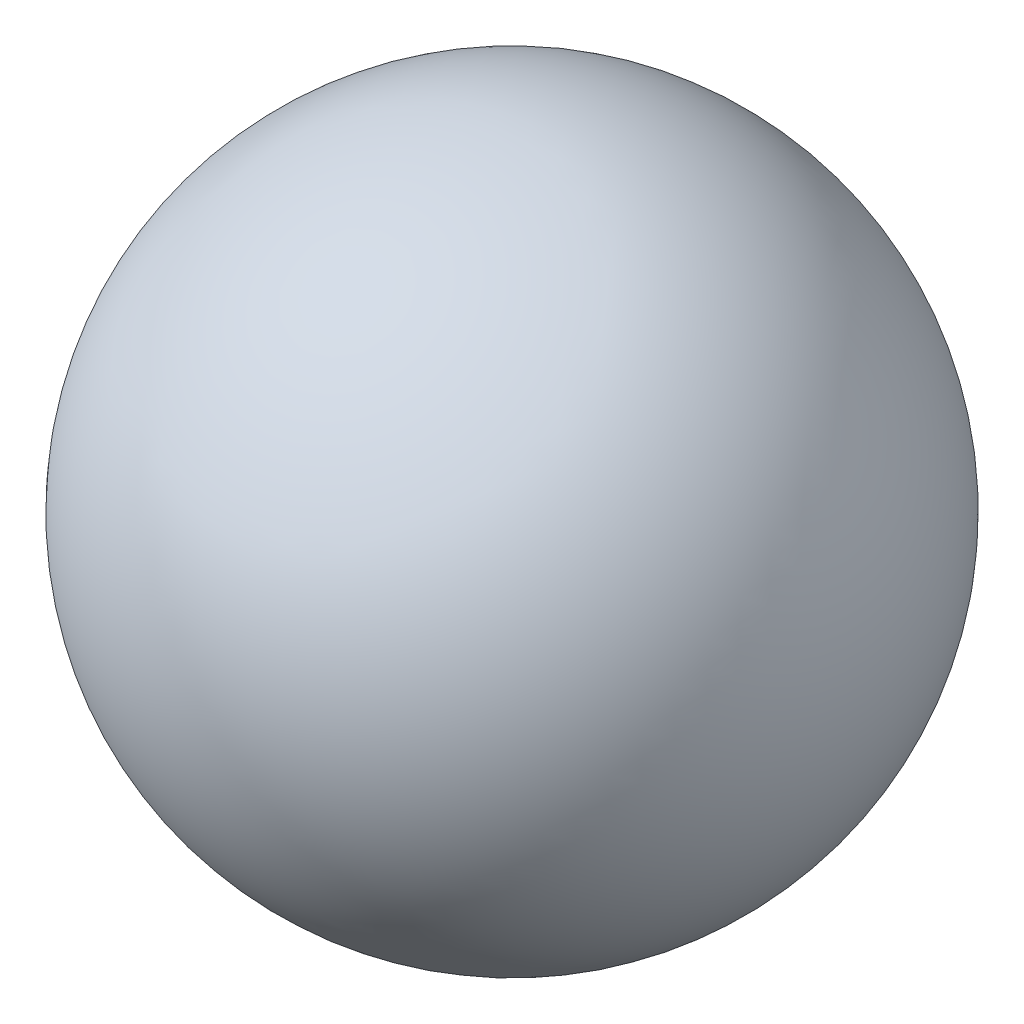
ISO-10303-21;
HEADER;
FILE_DESCRIPTION(('STEP AP214'),'2;1');
FILE_NAME('part.step','',(''),(''),'','','');
FILE_SCHEMA(('AUTOMOTIVE_DESIGN { 1 0 10303 214 1 1 1 1 }'));
ENDSEC;
DATA;
#1=APPLICATION_CONTEXT('core data for automotive mechanical design processes');
#2=APPLICATION_PROTOCOL_DEFINITION('international standard','automotive_design',2000,#1);
#3=PRODUCT_CONTEXT('',#1,'mechanical');
#4=PRODUCT('Part','Part','',(#3));
#5=PRODUCT_RELATED_PRODUCT_CATEGORY('part','',(#4));
#6=PRODUCT_DEFINITION_FORMATION('','',#4);
#7=PRODUCT_DEFINITION_CONTEXT('part definition',#1,'design');
#8=PRODUCT_DEFINITION('design','',#6,#7);
#9=PRODUCT_DEFINITION_SHAPE('','',#8);
#10=(LENGTH_UNIT() NAMED_UNIT(*) SI_UNIT(.MILLI.,.METRE.));
#11=(NAMED_UNIT(*) PLANE_ANGLE_UNIT() SI_UNIT($,.RADIAN.));
#12=(NAMED_UNIT(*) SI_UNIT($,.STERADIAN.) SOLID_ANGLE_UNIT());
#13=UNCERTAINTY_MEASURE_WITH_UNIT(LENGTH_MEASURE(1.E-05),#10,'distance_accuracy_value','');
#14=(GEOMETRIC_REPRESENTATION_CONTEXT(3) GLOBAL_UNCERTAINTY_ASSIGNED_CONTEXT((#13)) GLOBAL_UNIT_ASSIGNED_CONTEXT((#10,
#11,#12)) REPRESENTATION_CONTEXT('',''));
#15=CARTESIAN_POINT('',(0.,0.,0.));
#16=DIRECTION('',(0.,0.,1.));
#17=DIRECTION('',(1.,0.,0.));
#18=AXIS2_PLACEMENT_3D('',#15,#16,#17);
#19=CARTESIAN_POINT('',(0.,0.,0.));
#20=DIRECTION('',(0.786318338822423,0.,-0.617821551931903));
#21=DIRECTION('',(0.617821551931903,0.,0.786318338822423));
#22=AXIS2_PLACEMENT_3D('',#19,#20,#21);
#23=SPHERICAL_SURFACE('',#22,31.75);
#24=CARTESIAN_POINT('',(24.9656072576119,0.,-19.6158342738379));
#25=VERTEX_POINT('',#24);
#26=VERTEX_LOOP('',#25);
#27=FACE_BOUND('',#26,.T.);
#28=ADVANCED_FACE('F29',(#27),#23,.T.);
#29=CLOSED_SHELL('',(#28));
#30=MANIFOLD_SOLID_BREP('B2',#29);
#31=ADVANCED_BREP_SHAPE_REPRESENTATION('',(#18,#30),#14);
#32=SHAPE_DEFINITION_REPRESENTATION(#9,#31);
ENDSEC;
END-ISO-10303-21;
